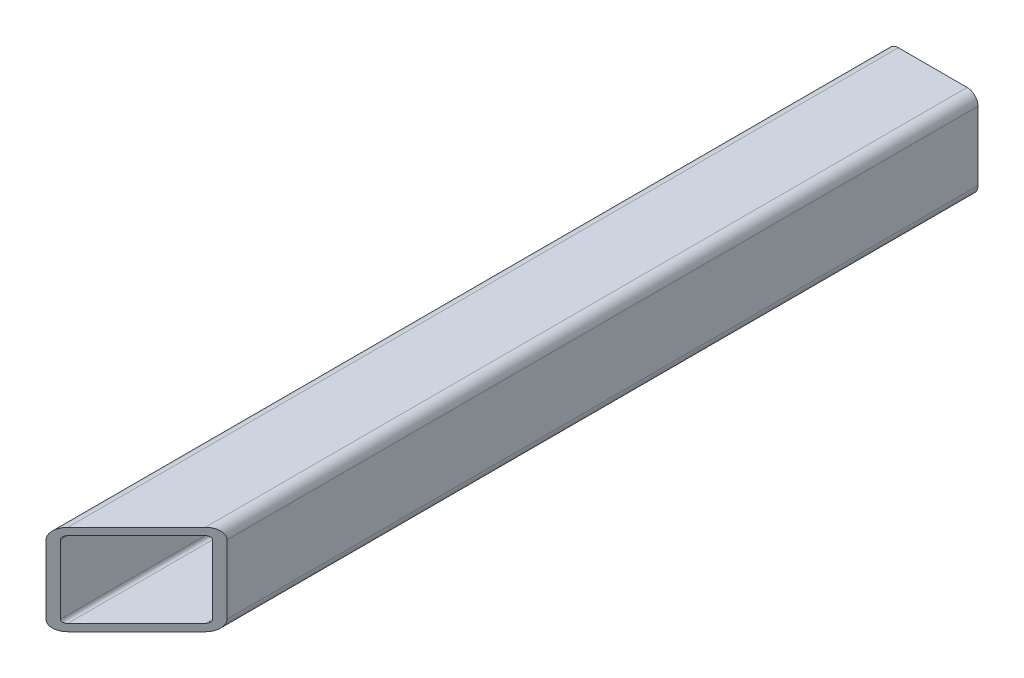
ISO-10303-21;
HEADER;
FILE_DESCRIPTION(('STEP AP214'),'2;1');
FILE_NAME('part.step','',(''),(''),'','','');
FILE_SCHEMA(('AUTOMOTIVE_DESIGN { 1 0 10303 214 1 1 1 1 }'));
ENDSEC;
DATA;
#1=APPLICATION_CONTEXT('core data for automotive mechanical design processes');
#2=APPLICATION_PROTOCOL_DEFINITION('international standard','automotive_design',2000,#1);
#3=PRODUCT_CONTEXT('',#1,'mechanical');
#4=PRODUCT('Part','Part','',(#3));
#5=PRODUCT_RELATED_PRODUCT_CATEGORY('part','',(#4));
#6=PRODUCT_DEFINITION_FORMATION('','',#4);
#7=PRODUCT_DEFINITION_CONTEXT('part definition',#1,'design');
#8=PRODUCT_DEFINITION('design','',#6,#7);
#9=PRODUCT_DEFINITION_SHAPE('','',#8);
#10=(LENGTH_UNIT() NAMED_UNIT(*) SI_UNIT(.MILLI.,.METRE.));
#11=(NAMED_UNIT(*) PLANE_ANGLE_UNIT() SI_UNIT($,.RADIAN.));
#12=(NAMED_UNIT(*) SI_UNIT($,.STERADIAN.) SOLID_ANGLE_UNIT());
#13=UNCERTAINTY_MEASURE_WITH_UNIT(LENGTH_MEASURE(1.E-05),#10,'distance_accuracy_value','');
#14=(GEOMETRIC_REPRESENTATION_CONTEXT(3) GLOBAL_UNCERTAINTY_ASSIGNED_CONTEXT((#13)) GLOBAL_UNIT_ASSIGNED_CONTEXT((#10,
#11,#12)) REPRESENTATION_CONTEXT('',''));
#15=CARTESIAN_POINT('',(0.,0.,0.));
#16=DIRECTION('',(0.,0.,1.));
#17=DIRECTION('',(1.,0.,0.));
#18=AXIS2_PLACEMENT_3D('',#15,#16,#17);
#19=CARTESIAN_POINT('',(0.,0.,0.));
#20=DIRECTION('',(0.,0.,1.));
#21=DIRECTION('',(1.,0.,0.));
#22=AXIS2_PLACEMENT_3D('',#19,#20,#21);
#23=PLANE('',#22);
#24=DIRECTION('',(0.,1.,0.));
#25=VECTOR('',#24,1.);
#26=CARTESIAN_POINT('',(-12.5,-4.75,0.));
#27=LINE('',#26,#25);
#28=CARTESIAN_POINT('',(-12.5,-9.5,0.));
#29=VERTEX_POINT('',#28);
#30=CARTESIAN_POINT('',(-12.5,9.5,0.));
#31=VERTEX_POINT('',#30);
#32=EDGE_CURVE('E11',#29,#31,#27,.T.);
#33=ORIENTED_EDGE('',*,*,#32,.T.);
#34=CARTESIAN_POINT('',(-9.5,9.5,0.));
#35=DIRECTION('',(0.,0.,-1.));
#36=DIRECTION('',(0.,-1.,0.));
#37=AXIS2_PLACEMENT_3D('',#34,#35,#36);
#38=CIRCLE('',#37,3.);
#39=CARTESIAN_POINT('',(-9.5,12.5,0.));
#40=VERTEX_POINT('',#39);
#41=EDGE_CURVE('E326',#31,#40,#38,.T.);
#42=ORIENTED_EDGE('',*,*,#41,.T.);
#43=DIRECTION('',(1.,0.,0.));
#44=VECTOR('',#43,1.);
#45=CARTESIAN_POINT('',(-4.75,12.5,0.));
#46=LINE('',#45,#44);
#47=CARTESIAN_POINT('',(9.5,12.5,0.));
#48=VERTEX_POINT('',#47);
#49=EDGE_CURVE('E229',#40,#48,#46,.T.);
#50=ORIENTED_EDGE('',*,*,#49,.T.);
#51=CARTESIAN_POINT('',(9.5,9.5,0.));
#52=DIRECTION('',(0.,0.,-1.));
#53=DIRECTION('',(-1.,0.,0.));
#54=AXIS2_PLACEMENT_3D('',#51,#52,#53);
#55=CIRCLE('',#54,3.);
#56=CARTESIAN_POINT('',(12.5,9.5,0.));
#57=VERTEX_POINT('',#56);
#58=EDGE_CURVE('E255',#48,#57,#55,.T.);
#59=ORIENTED_EDGE('',*,*,#58,.T.);
#60=DIRECTION('',(0.,-1.,0.));
#61=VECTOR('',#60,1.);
#62=CARTESIAN_POINT('',(12.5,4.75,0.));
#63=LINE('',#62,#61);
#64=CARTESIAN_POINT('',(12.5,-9.5,0.));
#65=VERTEX_POINT('',#64);
#66=EDGE_CURVE('E85',#57,#65,#63,.T.);
#67=ORIENTED_EDGE('',*,*,#66,.T.);
#68=CARTESIAN_POINT('',(9.5,-9.5,0.));
#69=DIRECTION('',(0.,0.,-1.));
#70=DIRECTION('',(0.,1.,0.));
#71=AXIS2_PLACEMENT_3D('',#68,#69,#70);
#72=CIRCLE('',#71,3.);
#73=CARTESIAN_POINT('',(9.5,-12.5,0.));
#74=VERTEX_POINT('',#73);
#75=EDGE_CURVE('E119',#65,#74,#72,.T.);
#76=ORIENTED_EDGE('',*,*,#75,.T.);
#77=DIRECTION('',(-1.,0.,0.));
#78=VECTOR('',#77,1.);
#79=CARTESIAN_POINT('',(4.75,-12.5,0.));
#80=LINE('',#79,#78);
#81=CARTESIAN_POINT('',(-9.5,-12.5,0.));
#82=VERTEX_POINT('',#81);
#83=EDGE_CURVE('E110',#74,#82,#80,.T.);
#84=ORIENTED_EDGE('',*,*,#83,.T.);
#85=CARTESIAN_POINT('',(-9.5,-9.5,0.));
#86=DIRECTION('',(0.,0.,-1.));
#87=DIRECTION('',(1.,0.,0.));
#88=AXIS2_PLACEMENT_3D('',#85,#86,#87);
#89=CIRCLE('',#88,3.);
#90=EDGE_CURVE('E27',#82,#29,#89,.T.);
#91=ORIENTED_EDGE('',*,*,#90,.T.);
#92=EDGE_LOOP('',(#33,#42,#50,#59,#67,#76,#84,#91));
#93=FACE_BOUND('',#92,.T.);
#94=DIRECTION('',(-1.,0.,0.));
#95=VECTOR('',#94,1.);
#96=CARTESIAN_POINT('',(-4.75,10.5,0.));
#97=LINE('',#96,#95);
#98=CARTESIAN_POINT('',(9.5,10.5,0.));
#99=VERTEX_POINT('',#98);
#100=CARTESIAN_POINT('',(-9.5,10.5,0.));
#101=VERTEX_POINT('',#100);
#102=EDGE_CURVE('E264',#99,#101,#97,.T.);
#103=ORIENTED_EDGE('',*,*,#102,.T.);
#104=CARTESIAN_POINT('',(-9.5,9.5,0.));
#105=DIRECTION('',(0.,0.,1.));
#106=DIRECTION('',(0.,-1.,0.));
#107=AXIS2_PLACEMENT_3D('',#104,#105,#106);
#108=CIRCLE('',#107,1.);
#109=CARTESIAN_POINT('',(-10.5,9.5,0.));
#110=VERTEX_POINT('',#109);
#111=EDGE_CURVE('E245',#101,#110,#108,.T.);
#112=ORIENTED_EDGE('',*,*,#111,.T.);
#113=DIRECTION('',(0.,-1.,0.));
#114=VECTOR('',#113,1.);
#115=CARTESIAN_POINT('',(-10.5,-4.75,0.));
#116=LINE('',#115,#114);
#117=CARTESIAN_POINT('',(-10.5,-9.5,0.));
#118=VERTEX_POINT('',#117);
#119=EDGE_CURVE('E207',#110,#118,#116,.T.);
#120=ORIENTED_EDGE('',*,*,#119,.T.);
#121=CARTESIAN_POINT('',(-9.5,-9.5,0.));
#122=DIRECTION('',(0.,0.,1.));
#123=DIRECTION('',(1.,0.,0.));
#124=AXIS2_PLACEMENT_3D('',#121,#122,#123);
#125=CIRCLE('',#124,1.);
#126=CARTESIAN_POINT('',(-9.5,-10.5,0.));
#127=VERTEX_POINT('',#126);
#128=EDGE_CURVE('E206',#118,#127,#125,.T.);
#129=ORIENTED_EDGE('',*,*,#128,.T.);
#130=DIRECTION('',(1.,0.,0.));
#131=VECTOR('',#130,1.);
#132=CARTESIAN_POINT('',(4.75,-10.5,0.));
#133=LINE('',#132,#131);
#134=CARTESIAN_POINT('',(9.5,-10.5,0.));
#135=VERTEX_POINT('',#134);
#136=EDGE_CURVE('E203',#127,#135,#133,.T.);
#137=ORIENTED_EDGE('',*,*,#136,.T.);
#138=CARTESIAN_POINT('',(9.5,-9.5,0.));
#139=DIRECTION('',(0.,0.,1.));
#140=DIRECTION('',(0.,1.,0.));
#141=AXIS2_PLACEMENT_3D('',#138,#139,#140);
#142=CIRCLE('',#141,1.);
#143=CARTESIAN_POINT('',(10.5,-9.5,0.));
#144=VERTEX_POINT('',#143);
#145=EDGE_CURVE('E71',#135,#144,#142,.T.);
#146=ORIENTED_EDGE('',*,*,#145,.T.);
#147=DIRECTION('',(0.,1.,0.));
#148=VECTOR('',#147,1.);
#149=CARTESIAN_POINT('',(10.5,4.75,0.));
#150=LINE('',#149,#148);
#151=CARTESIAN_POINT('',(10.5,9.5,0.));
#152=VERTEX_POINT('',#151);
#153=EDGE_CURVE('E249',#144,#152,#150,.T.);
#154=ORIENTED_EDGE('',*,*,#153,.T.);
#155=CARTESIAN_POINT('',(9.5,9.5,0.));
#156=DIRECTION('',(0.,0.,1.));
#157=DIRECTION('',(-1.,0.,0.));
#158=AXIS2_PLACEMENT_3D('',#155,#156,#157);
#159=CIRCLE('',#158,1.);
#160=EDGE_CURVE('E253',#152,#99,#159,.T.);
#161=ORIENTED_EDGE('',*,*,#160,.T.);
#162=EDGE_LOOP('',(#103,#112,#120,#129,#137,#146,#154,#161));
#163=FACE_BOUND('',#162,.T.);
#164=ADVANCED_FACE('F16',(#93,#163),#23,.F.);
#165=CARTESIAN_POINT('',(-12.5,-9.5,0.));
#166=DIRECTION('',(-1.,0.,0.));
#167=DIRECTION('',(0.,1.,0.));
#168=AXIS2_PLACEMENT_3D('',#165,#166,#167);
#169=PLANE('',#168);
#170=DIRECTION('',(0.,1.,0.));
#171=VECTOR('',#170,1.);
#172=CARTESIAN_POINT('',(-12.5,-4.75,232.5000001));
#173=LINE('',#172,#171);
#174=CARTESIAN_POINT('',(-12.5,-9.5,232.5000001));
#175=VERTEX_POINT('',#174);
#176=CARTESIAN_POINT('',(-12.5,9.5,232.5000001));
#177=VERTEX_POINT('',#176);
#178=EDGE_CURVE('E235',#175,#177,#173,.T.);
#179=ORIENTED_EDGE('',*,*,#178,.T.);
#180=DIRECTION('',(0.,0.,1.));
#181=VECTOR('',#180,1.);
#182=CARTESIAN_POINT('',(-12.5,9.5,0.));
#183=LINE('',#182,#181);
#184=EDGE_CURVE('E323',#31,#177,#183,.T.);
#185=ORIENTED_EDGE('',*,*,#184,.F.);
#186=ORIENTED_EDGE('',*,*,#32,.F.);
#187=DIRECTION('',(0.,0.,1.));
#188=VECTOR('',#187,1.);
#189=CARTESIAN_POINT('',(-12.5,-9.5,0.));
#190=LINE('',#189,#188);
#191=EDGE_CURVE('E20',#29,#175,#190,.T.);
#192=ORIENTED_EDGE('',*,*,#191,.T.);
#193=EDGE_LOOP('',(#179,#185,#186,#192));
#194=FACE_BOUND('',#193,.T.);
#195=ADVANCED_FACE('F517',(#194),#169,.T.);
#196=CARTESIAN_POINT('',(-9.5,-9.5,0.));
#197=DIRECTION('',(0.,0.,1.));
#198=DIRECTION('',(1.,0.,0.));
#199=AXIS2_PLACEMENT_3D('',#196,#197,#198);
#200=CYLINDRICAL_SURFACE('',#199,3.);
#201=CARTESIAN_POINT('',(-9.5,-9.5,229.500000000947));
#202=DIRECTION('',(-0.707106781186547,0.,-0.707106781186548));
#203=DIRECTION('',(0.707106781186548,0.,-0.707106781186547));
#204=AXIS2_PLACEMENT_3D('',#201,#202,#203);
#205=ELLIPSE('',#204,4.24264068711928,3.);
#206=CARTESIAN_POINT('',(-9.5,-12.5,229.500000000947));
#207=VERTEX_POINT('',#206);
#208=EDGE_CURVE('E306',#207,#175,#205,.T.);
#209=ORIENTED_EDGE('',*,*,#208,.T.);
#210=ORIENTED_EDGE('',*,*,#191,.F.);
#211=ORIENTED_EDGE('',*,*,#90,.F.);
#212=DIRECTION('',(0.,0.,1.));
#213=VECTOR('',#212,1.);
#214=CARTESIAN_POINT('',(-9.5,-12.5,0.));
#215=LINE('',#214,#213);
#216=EDGE_CURVE('E271',#82,#207,#215,.T.);
#217=ORIENTED_EDGE('',*,*,#216,.T.);
#218=EDGE_LOOP('',(#209,#210,#211,#217));
#219=FACE_BOUND('',#218,.T.);
#220=ADVANCED_FACE('F511',(#219),#200,.T.);
#221=CARTESIAN_POINT('',(9.5,-12.5,0.));
#222=DIRECTION('',(0.,-1.,0.));
#223=DIRECTION('',(0.,0.,-1.));
#224=AXIS2_PLACEMENT_3D('',#221,#222,#223);
#225=PLANE('',#224);
#226=DIRECTION('',(-0.707106781186548,0.,0.707106781186547));
#227=VECTOR('',#226,1.);
#228=CARTESIAN_POINT('',(112.375000000473,-12.5,107.625000000473));
#229=LINE('',#228,#227);
#230=CARTESIAN_POINT('',(9.5,-12.5,210.500000000947));
#231=VERTEX_POINT('',#230);
#232=EDGE_CURVE('E301',#231,#207,#229,.T.);
#233=ORIENTED_EDGE('',*,*,#232,.T.);
#234=ORIENTED_EDGE('',*,*,#216,.F.);
#235=ORIENTED_EDGE('',*,*,#83,.F.);
#236=DIRECTION('',(0.,0.,1.));
#237=VECTOR('',#236,1.);
#238=CARTESIAN_POINT('',(9.5,-12.5,0.));
#239=LINE('',#238,#237);
#240=EDGE_CURVE('E262',#74,#231,#239,.T.);
#241=ORIENTED_EDGE('',*,*,#240,.T.);
#242=EDGE_LOOP('',(#233,#234,#235,#241));
#243=FACE_BOUND('',#242,.T.);
#244=ADVANCED_FACE('F516',(#243),#225,.T.);
#245=CARTESIAN_POINT('',(9.5,-9.5,0.));
#246=DIRECTION('',(0.,0.,1.));
#247=DIRECTION('',(0.,1.,0.));
#248=AXIS2_PLACEMENT_3D('',#245,#246,#247);
#249=CYLINDRICAL_SURFACE('',#248,3.);
#250=CARTESIAN_POINT('',(9.5,-9.5,210.500000000947));
#251=DIRECTION('',(-0.707106781186547,0.,-0.707106781186548));
#252=DIRECTION('',(-0.707106781186548,0.,0.707106781186547));
#253=AXIS2_PLACEMENT_3D('',#250,#251,#252);
#254=ELLIPSE('',#253,4.24264068711928,3.);
#255=CARTESIAN_POINT('',(12.5,-9.5,207.500000000947));
#256=VERTEX_POINT('',#255);
#257=EDGE_CURVE('E305',#256,#231,#254,.T.);
#258=ORIENTED_EDGE('',*,*,#257,.T.);
#259=ORIENTED_EDGE('',*,*,#240,.F.);
#260=ORIENTED_EDGE('',*,*,#75,.F.);
#261=DIRECTION('',(0.,0.,1.));
#262=VECTOR('',#261,1.);
#263=CARTESIAN_POINT('',(12.5,-9.5,0.));
#264=LINE('',#263,#262);
#265=EDGE_CURVE('E263',#65,#256,#264,.T.);
#266=ORIENTED_EDGE('',*,*,#265,.T.);
#267=EDGE_LOOP('',(#258,#259,#260,#266));
#268=FACE_BOUND('',#267,.T.);
#269=ADVANCED_FACE('F550',(#268),#249,.T.);
#270=CARTESIAN_POINT('',(12.5,9.5,0.));
#271=DIRECTION('',(1.,0.,0.));
#272=DIRECTION('',(0.,1.,0.));
#273=AXIS2_PLACEMENT_3D('',#270,#271,#272);
#274=PLANE('',#273);
#275=DIRECTION('',(0.,-1.,0.));
#276=VECTOR('',#275,1.);
#277=CARTESIAN_POINT('',(12.5,4.75,207.500000000947));
#278=LINE('',#277,#276);
#279=CARTESIAN_POINT('',(12.5,9.5,207.500000000947));
#280=VERTEX_POINT('',#279);
#281=EDGE_CURVE('E244',#280,#256,#278,.T.);
#282=ORIENTED_EDGE('',*,*,#281,.T.);
#283=ORIENTED_EDGE('',*,*,#265,.F.);
#284=ORIENTED_EDGE('',*,*,#66,.F.);
#285=DIRECTION('',(0.,0.,1.));
#286=VECTOR('',#285,1.);
#287=CARTESIAN_POINT('',(12.5,9.5,0.));
#288=LINE('',#287,#286);
#289=EDGE_CURVE('E259',#57,#280,#288,.T.);
#290=ORIENTED_EDGE('',*,*,#289,.T.);
#291=EDGE_LOOP('',(#282,#283,#284,#290));
#292=FACE_BOUND('',#291,.T.);
#293=ADVANCED_FACE('F545',(#292),#274,.T.);
#294=CARTESIAN_POINT('',(9.5,9.5,0.));
#295=DIRECTION('',(0.,0.,1.));
#296=DIRECTION('',(-1.,0.,0.));
#297=AXIS2_PLACEMENT_3D('',#294,#295,#296);
#298=CYLINDRICAL_SURFACE('',#297,1.);
#299=CARTESIAN_POINT('',(9.5,9.5,210.500000000947));
#300=DIRECTION('',(0.707106781186547,0.,0.707106781186548));
#301=DIRECTION('',(-0.707106781186548,0.,0.707106781186547));
#302=AXIS2_PLACEMENT_3D('',#299,#300,#301);
#303=ELLIPSE('',#302,1.4142135623731,1.);
#304=CARTESIAN_POINT('',(10.5,9.5,209.500000000947));
#305=VERTEX_POINT('',#304);
#306=CARTESIAN_POINT('',(9.5,10.5,210.500000000947));
#307=VERTEX_POINT('',#306);
#308=EDGE_CURVE('E282',#305,#307,#303,.T.);
#309=ORIENTED_EDGE('',*,*,#308,.T.);
#310=DIRECTION('',(0.,0.,1.));
#311=VECTOR('',#310,1.);
#312=CARTESIAN_POINT('',(9.5,10.5,0.));
#313=LINE('',#312,#311);
#314=EDGE_CURVE('E268',#99,#307,#313,.T.);
#315=ORIENTED_EDGE('',*,*,#314,.F.);
#316=ORIENTED_EDGE('',*,*,#160,.F.);
#317=DIRECTION('',(0.,0.,1.));
#318=VECTOR('',#317,1.);
#319=CARTESIAN_POINT('',(10.5,9.5,0.));
#320=LINE('',#319,#318);
#321=EDGE_CURVE('E254',#152,#305,#320,.T.);
#322=ORIENTED_EDGE('',*,*,#321,.T.);
#323=EDGE_LOOP('',(#309,#315,#316,#322));
#324=FACE_BOUND('',#323,.T.);
#325=ADVANCED_FACE('F381',(#324),#298,.F.);
#326=CARTESIAN_POINT('',(10.5,9.5,0.));
#327=DIRECTION('',(1.,0.,0.));
#328=DIRECTION('',(0.,-1.,0.));
#329=AXIS2_PLACEMENT_3D('',#326,#327,#328);
#330=PLANE('',#329);
#331=DIRECTION('',(0.,1.,0.));
#332=VECTOR('',#331,1.);
#333=CARTESIAN_POINT('',(10.5,4.75,209.500000000947));
#334=LINE('',#333,#332);
#335=CARTESIAN_POINT('',(10.5,-9.5,209.500000000947));
#336=VERTEX_POINT('',#335);
#337=EDGE_CURVE('E274',#336,#305,#334,.T.);
#338=ORIENTED_EDGE('',*,*,#337,.T.);
#339=ORIENTED_EDGE('',*,*,#321,.F.);
#340=ORIENTED_EDGE('',*,*,#153,.F.);
#341=DIRECTION('',(0.,0.,1.));
#342=VECTOR('',#341,1.);
#343=CARTESIAN_POINT('',(10.5,-9.5,0.));
#344=LINE('',#343,#342);
#345=EDGE_CURVE('E295',#144,#336,#344,.T.);
#346=ORIENTED_EDGE('',*,*,#345,.T.);
#347=EDGE_LOOP('',(#338,#339,#340,#346));
#348=FACE_BOUND('',#347,.T.);
#349=ADVANCED_FACE('F382',(#348),#330,.F.);
#350=CARTESIAN_POINT('',(9.5,-9.5,0.));
#351=DIRECTION('',(0.,0.,1.));
#352=DIRECTION('',(0.,1.,0.));
#353=AXIS2_PLACEMENT_3D('',#350,#351,#352);
#354=CYLINDRICAL_SURFACE('',#353,1.);
#355=CARTESIAN_POINT('',(9.5,-9.5,210.500000000947));
#356=DIRECTION('',(0.707106781186547,0.,0.707106781186548));
#357=DIRECTION('',(-0.707106781186548,0.,0.707106781186547));
#358=AXIS2_PLACEMENT_3D('',#355,#356,#357);
#359=ELLIPSE('',#358,1.4142135623731,1.);
#360=CARTESIAN_POINT('',(9.5,-10.5,210.500000000947));
#361=VERTEX_POINT('',#360);
#362=EDGE_CURVE('E221',#361,#336,#359,.T.);
#363=ORIENTED_EDGE('',*,*,#362,.T.);
#364=ORIENTED_EDGE('',*,*,#345,.F.);
#365=ORIENTED_EDGE('',*,*,#145,.F.);
#366=DIRECTION('',(0.,0.,1.));
#367=VECTOR('',#366,1.);
#368=CARTESIAN_POINT('',(9.5,-10.5,0.));
#369=LINE('',#368,#367);
#370=EDGE_CURVE('E258',#135,#361,#369,.T.);
#371=ORIENTED_EDGE('',*,*,#370,.T.);
#372=EDGE_LOOP('',(#363,#364,#365,#371));
#373=FACE_BOUND('',#372,.T.);
#374=ADVANCED_FACE('F383',(#373),#354,.F.);
#375=CARTESIAN_POINT('',(9.5,-10.5,0.));
#376=DIRECTION('',(0.,-1.,0.));
#377=DIRECTION('',(0.,0.,-1.));
#378=AXIS2_PLACEMENT_3D('',#375,#376,#377);
#379=PLANE('',#378);
#380=DIRECTION('',(0.707106781186548,0.,-0.707106781186547));
#381=VECTOR('',#380,1.);
#382=CARTESIAN_POINT('',(112.375000000473,-10.5,107.625000000473));
#383=LINE('',#382,#381);
#384=CARTESIAN_POINT('',(-9.5,-10.5,229.500000000947));
#385=VERTEX_POINT('',#384);
#386=EDGE_CURVE('E202',#385,#361,#383,.T.);
#387=ORIENTED_EDGE('',*,*,#386,.T.);
#388=ORIENTED_EDGE('',*,*,#370,.F.);
#389=ORIENTED_EDGE('',*,*,#136,.F.);
#390=DIRECTION('',(0.,0.,1.));
#391=VECTOR('',#390,1.);
#392=CARTESIAN_POINT('',(-9.5,-10.5,0.));
#393=LINE('',#392,#391);
#394=EDGE_CURVE('E198',#127,#385,#393,.T.);
#395=ORIENTED_EDGE('',*,*,#394,.T.);
#396=EDGE_LOOP('',(#387,#388,#389,#395));
#397=FACE_BOUND('',#396,.T.);
#398=ADVANCED_FACE('F199',(#397),#379,.F.);
#399=CARTESIAN_POINT('',(9.5,9.5,0.));
#400=DIRECTION('',(0.,0.,1.));
#401=DIRECTION('',(-1.,0.,0.));
#402=AXIS2_PLACEMENT_3D('',#399,#400,#401);
#403=CYLINDRICAL_SURFACE('',#402,3.);
#404=CARTESIAN_POINT('',(9.5,9.5,210.500000000947));
#405=DIRECTION('',(-0.707106781186547,0.,-0.707106781186548));
#406=DIRECTION('',(-0.707106781186548,0.,0.707106781186547));
#407=AXIS2_PLACEMENT_3D('',#404,#405,#406);
#408=ELLIPSE('',#407,4.24264068711928,3.);
#409=CARTESIAN_POINT('',(9.5,12.5,210.500000000947));
#410=VERTEX_POINT('',#409);
#411=EDGE_CURVE('E240',#410,#280,#408,.T.);
#412=ORIENTED_EDGE('',*,*,#411,.T.);
#413=ORIENTED_EDGE('',*,*,#289,.F.);
#414=ORIENTED_EDGE('',*,*,#58,.F.);
#415=DIRECTION('',(0.,0.,1.));
#416=VECTOR('',#415,1.);
#417=CARTESIAN_POINT('',(9.5,12.5,0.));
#418=LINE('',#417,#416);
#419=EDGE_CURVE('E325',#48,#410,#418,.T.);
#420=ORIENTED_EDGE('',*,*,#419,.T.);
#421=EDGE_LOOP('',(#412,#413,#414,#420));
#422=FACE_BOUND('',#421,.T.);
#423=ADVANCED_FACE('F533',(#422),#403,.T.);
#424=CARTESIAN_POINT('',(-9.5,12.5,0.));
#425=DIRECTION('',(0.,1.,0.));
#426=DIRECTION('',(1.,0.,0.));
#427=AXIS2_PLACEMENT_3D('',#424,#425,#426);
#428=PLANE('',#427);
#429=DIRECTION('',(0.707106781186548,0.,-0.707106781186547));
#430=VECTOR('',#429,1.);
#431=CARTESIAN_POINT('',(107.625000000473,12.5,112.375000000473));
#432=LINE('',#431,#430);
#433=CARTESIAN_POINT('',(-9.5,12.5,229.500000000947));
#434=VERTEX_POINT('',#433);
#435=EDGE_CURVE('E236',#434,#410,#432,.T.);
#436=ORIENTED_EDGE('',*,*,#435,.T.);
#437=ORIENTED_EDGE('',*,*,#419,.F.);
#438=ORIENTED_EDGE('',*,*,#49,.F.);
#439=DIRECTION('',(0.,0.,1.));
#440=VECTOR('',#439,1.);
#441=CARTESIAN_POINT('',(-9.5,12.5,0.));
#442=LINE('',#441,#440);
#443=EDGE_CURVE('E352',#40,#434,#442,.T.);
#444=ORIENTED_EDGE('',*,*,#443,.T.);
#445=EDGE_LOOP('',(#436,#437,#438,#444));
#446=FACE_BOUND('',#445,.T.);
#447=ADVANCED_FACE('F538',(#446),#428,.T.);
#448=CARTESIAN_POINT('',(-9.5,9.5,0.));
#449=DIRECTION('',(0.,0.,1.));
#450=DIRECTION('',(0.,-1.,0.));
#451=AXIS2_PLACEMENT_3D('',#448,#449,#450);
#452=CYLINDRICAL_SURFACE('',#451,3.);
#453=CARTESIAN_POINT('',(-9.5,9.5,229.500000000947));
#454=DIRECTION('',(-0.707106781186547,0.,-0.707106781186548));
#455=DIRECTION('',(0.707106781186548,0.,-0.707106781186547));
#456=AXIS2_PLACEMENT_3D('',#453,#454,#455);
#457=ELLIPSE('',#456,4.24264068711928,3.);
#458=EDGE_CURVE('E231',#177,#434,#457,.T.);
#459=ORIENTED_EDGE('',*,*,#458,.T.);
#460=ORIENTED_EDGE('',*,*,#443,.F.);
#461=ORIENTED_EDGE('',*,*,#41,.F.);
#462=ORIENTED_EDGE('',*,*,#184,.T.);
#463=EDGE_LOOP('',(#459,#460,#461,#462));
#464=FACE_BOUND('',#463,.T.);
#465=ADVANCED_FACE('F18',(#464),#452,.T.);
#466=CARTESIAN_POINT('',(-9.5,-9.5,0.));
#467=DIRECTION('',(0.,0.,1.));
#468=DIRECTION('',(1.,0.,0.));
#469=AXIS2_PLACEMENT_3D('',#466,#467,#468);
#470=CYLINDRICAL_SURFACE('',#469,1.);
#471=CARTESIAN_POINT('',(-9.5,-9.5,229.500000000947));
#472=DIRECTION('',(0.707106781186547,0.,0.707106781186548));
#473=DIRECTION('',(0.707106781186548,0.,-0.707106781186547));
#474=AXIS2_PLACEMENT_3D('',#471,#472,#473);
#475=ELLIPSE('',#474,1.4142135623731,1.);
#476=CARTESIAN_POINT('',(-10.5,-9.5,230.500000000947));
#477=VERTEX_POINT('',#476);
#478=EDGE_CURVE('E210',#477,#385,#475,.T.);
#479=ORIENTED_EDGE('',*,*,#478,.T.);
#480=ORIENTED_EDGE('',*,*,#394,.F.);
#481=ORIENTED_EDGE('',*,*,#128,.F.);
#482=DIRECTION('',(0.,0.,1.));
#483=VECTOR('',#482,1.);
#484=CARTESIAN_POINT('',(-10.5,-9.5,0.));
#485=LINE('',#484,#483);
#486=EDGE_CURVE('E183',#118,#477,#485,.T.);
#487=ORIENTED_EDGE('',*,*,#486,.T.);
#488=EDGE_LOOP('',(#479,#480,#481,#487));
#489=FACE_BOUND('',#488,.T.);
#490=ADVANCED_FACE('F211',(#489),#470,.F.);
#491=CARTESIAN_POINT('',(-10.5,-9.5,0.));
#492=DIRECTION('',(-1.,0.,0.));
#493=DIRECTION('',(0.,0.,1.));
#494=AXIS2_PLACEMENT_3D('',#491,#492,#493);
#495=PLANE('',#494);
#496=DIRECTION('',(0.,-1.,0.));
#497=VECTOR('',#496,1.);
#498=CARTESIAN_POINT('',(-10.5,-4.75,230.500000000947));
#499=LINE('',#498,#497);
#500=CARTESIAN_POINT('',(-10.5,9.5,230.500000000947));
#501=VERTEX_POINT('',#500);
#502=EDGE_CURVE('E215',#501,#477,#499,.T.);
#503=ORIENTED_EDGE('',*,*,#502,.T.);
#504=ORIENTED_EDGE('',*,*,#486,.F.);
#505=ORIENTED_EDGE('',*,*,#119,.F.);
#506=DIRECTION('',(0.,0.,1.));
#507=VECTOR('',#506,1.);
#508=CARTESIAN_POINT('',(-10.5,9.5,0.));
#509=LINE('',#508,#507);
#510=EDGE_CURVE('E174',#110,#501,#509,.T.);
#511=ORIENTED_EDGE('',*,*,#510,.T.);
#512=EDGE_LOOP('',(#503,#504,#505,#511));
#513=FACE_BOUND('',#512,.T.);
#514=ADVANCED_FACE('F505',(#513),#495,.F.);
#515=CARTESIAN_POINT('',(-9.5,9.5,0.));
#516=DIRECTION('',(0.,0.,1.));
#517=DIRECTION('',(0.,-1.,0.));
#518=AXIS2_PLACEMENT_3D('',#515,#516,#517);
#519=CYLINDRICAL_SURFACE('',#518,1.);
#520=CARTESIAN_POINT('',(-9.5,9.5,229.500000000947));
#521=DIRECTION('',(0.707106781186547,0.,0.707106781186548));
#522=DIRECTION('',(0.707106781186548,0.,-0.707106781186547));
#523=AXIS2_PLACEMENT_3D('',#520,#521,#522);
#524=ELLIPSE('',#523,1.4142135623731,1.);
#525=CARTESIAN_POINT('',(-9.5,10.5,229.500000000947));
#526=VERTEX_POINT('',#525);
#527=EDGE_CURVE('E322',#526,#501,#524,.T.);
#528=ORIENTED_EDGE('',*,*,#527,.T.);
#529=ORIENTED_EDGE('',*,*,#510,.F.);
#530=ORIENTED_EDGE('',*,*,#111,.F.);
#531=DIRECTION('',(0.,0.,1.));
#532=VECTOR('',#531,1.);
#533=CARTESIAN_POINT('',(-9.5,10.5,0.));
#534=LINE('',#533,#532);
#535=EDGE_CURVE('E161',#101,#526,#534,.T.);
#536=ORIENTED_EDGE('',*,*,#535,.T.);
#537=EDGE_LOOP('',(#528,#529,#530,#536));
#538=FACE_BOUND('',#537,.T.);
#539=ADVANCED_FACE('F372',(#538),#519,.F.);
#540=CARTESIAN_POINT('',(-9.5,10.5,0.));
#541=DIRECTION('',(0.,1.,0.));
#542=DIRECTION('',(1.,0.,0.));
#543=AXIS2_PLACEMENT_3D('',#540,#541,#542);
#544=PLANE('',#543);
#545=DIRECTION('',(-0.707106781186548,0.,0.707106781186547));
#546=VECTOR('',#545,1.);
#547=CARTESIAN_POINT('',(107.625000000473,10.5,112.375000000473));
#548=LINE('',#547,#546);
#549=EDGE_CURVE('E291',#307,#526,#548,.T.);
#550=ORIENTED_EDGE('',*,*,#549,.T.);
#551=ORIENTED_EDGE('',*,*,#535,.F.);
#552=ORIENTED_EDGE('',*,*,#102,.F.);
#553=ORIENTED_EDGE('',*,*,#314,.T.);
#554=EDGE_LOOP('',(#550,#551,#552,#553));
#555=FACE_BOUND('',#554,.T.);
#556=ADVANCED_FACE('F369',(#555),#544,.F.);
#557=CARTESIAN_POINT('',(110.000000000473,0.,110.000000000473));
#558=DIRECTION('',(-0.707106781186547,0.,-0.707106781186548));
#559=DIRECTION('',(-0.707106781186548,0.,0.707106781186547));
#560=AXIS2_PLACEMENT_3D('',#557,#558,#559);
#561=PLANE('',#560);
#562=ORIENTED_EDGE('',*,*,#281,.F.);
#563=ORIENTED_EDGE('',*,*,#411,.F.);
#564=ORIENTED_EDGE('',*,*,#435,.F.);
#565=ORIENTED_EDGE('',*,*,#458,.F.);
#566=ORIENTED_EDGE('',*,*,#178,.F.);
#567=ORIENTED_EDGE('',*,*,#208,.F.);
#568=ORIENTED_EDGE('',*,*,#232,.F.);
#569=ORIENTED_EDGE('',*,*,#257,.F.);
#570=EDGE_LOOP('',(#562,#563,#564,#565,#566,#567,#568,#569));
#571=FACE_BOUND('',#570,.T.);
#572=ORIENTED_EDGE('',*,*,#386,.F.);
#573=ORIENTED_EDGE('',*,*,#478,.F.);
#574=ORIENTED_EDGE('',*,*,#502,.F.);
#575=ORIENTED_EDGE('',*,*,#527,.F.);
#576=ORIENTED_EDGE('',*,*,#549,.F.);
#577=ORIENTED_EDGE('',*,*,#308,.F.);
#578=ORIENTED_EDGE('',*,*,#337,.F.);
#579=ORIENTED_EDGE('',*,*,#362,.F.);
#580=EDGE_LOOP('',(#572,#573,#574,#575,#576,#577,#578,#579));
#581=FACE_BOUND('',#580,.T.);
#582=ADVANCED_FACE('F218',(#571,#581),#561,.F.);
#583=CLOSED_SHELL('',(#164,#195,#220,#244,#269,#293,#325,#349,#374,#398,#423,#447,#465,#490,
#514,#539,#556,#582));
#584=MANIFOLD_SOLID_BREP('B1',#583);
#585=ADVANCED_BREP_SHAPE_REPRESENTATION('',(#18,#584),#14);
#586=SHAPE_DEFINITION_REPRESENTATION(#9,#585);
ENDSEC;
END-ISO-10303-21;
